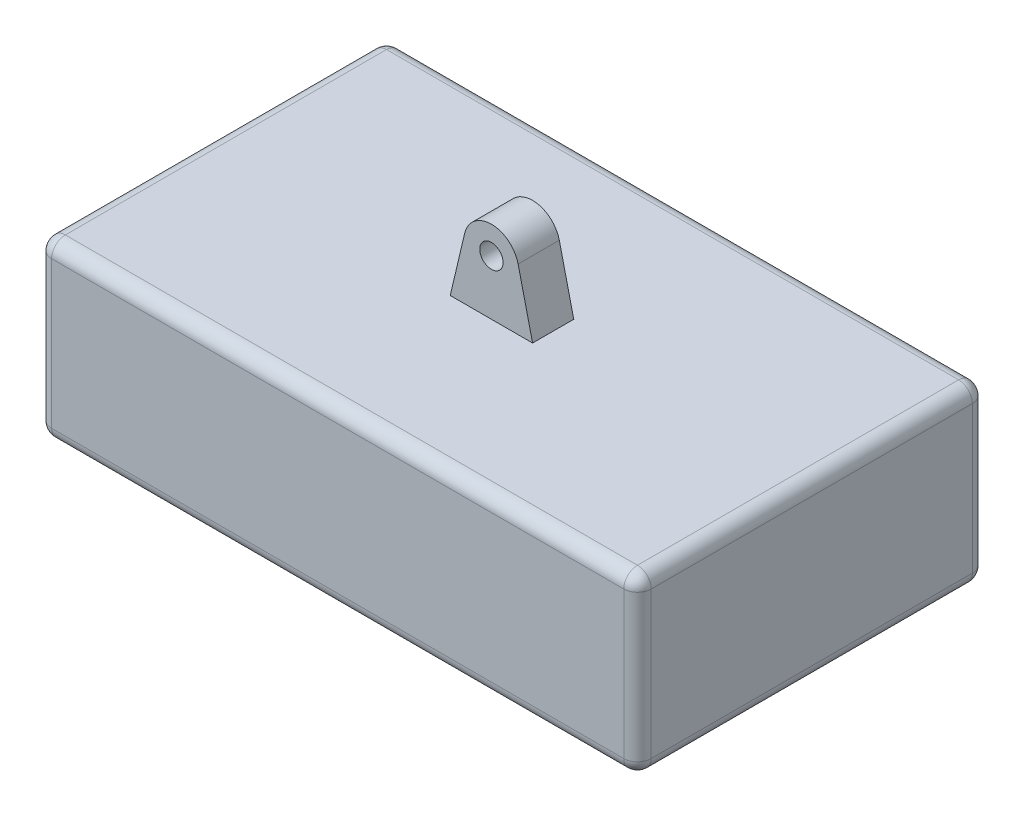
ISO-10303-21;
HEADER;
FILE_DESCRIPTION(('STEP AP214'),'2;1');
FILE_NAME('part.step','',(''),(''),'','','');
FILE_SCHEMA(('AUTOMOTIVE_DESIGN { 1 0 10303 214 1 1 1 1 }'));
ENDSEC;
DATA;
#1=APPLICATION_CONTEXT('core data for automotive mechanical design processes');
#2=APPLICATION_PROTOCOL_DEFINITION('international standard','automotive_design',2000,#1);
#3=PRODUCT_CONTEXT('',#1,'mechanical');
#4=PRODUCT('Part','Part','',(#3));
#5=PRODUCT_RELATED_PRODUCT_CATEGORY('part','',(#4));
#6=PRODUCT_DEFINITION_FORMATION('','',#4);
#7=PRODUCT_DEFINITION_CONTEXT('part definition',#1,'design');
#8=PRODUCT_DEFINITION('design','',#6,#7);
#9=PRODUCT_DEFINITION_SHAPE('','',#8);
#10=(LENGTH_UNIT() NAMED_UNIT(*) SI_UNIT(.MILLI.,.METRE.));
#11=(NAMED_UNIT(*) PLANE_ANGLE_UNIT() SI_UNIT($,.RADIAN.));
#12=(NAMED_UNIT(*) SI_UNIT($,.STERADIAN.) SOLID_ANGLE_UNIT());
#13=UNCERTAINTY_MEASURE_WITH_UNIT(LENGTH_MEASURE(1.E-05),#10,'distance_accuracy_value','');
#14=(GEOMETRIC_REPRESENTATION_CONTEXT(3) GLOBAL_UNCERTAINTY_ASSIGNED_CONTEXT((#13)) GLOBAL_UNIT_ASSIGNED_CONTEXT((#10,
#11,#12)) REPRESENTATION_CONTEXT('',''));
#15=CARTESIAN_POINT('',(0.,0.,0.));
#16=DIRECTION('',(0.,0.,1.));
#17=DIRECTION('',(1.,0.,0.));
#18=AXIS2_PLACEMENT_3D('',#15,#16,#17);
#19=CARTESIAN_POINT('',(-15.,93.5,-7.5));
#20=DIRECTION('',(0.,0.,1.));
#21=DIRECTION('',(1.,0.,0.));
#22=AXIS2_PLACEMENT_3D('',#19,#20,#21);
#23=PLANE('',#22);
#24=CARTESIAN_POINT('',(0.,83.5,-7.5));
#25=DIRECTION('',(0.,0.,-1.));
#26=DIRECTION('',(-1.,0.,0.));
#27=AXIS2_PLACEMENT_3D('',#24,#25,#26);
#28=CIRCLE('',#27,4.25);
#29=CARTESIAN_POINT('',(-4.25,83.5,-7.5));
#30=VERTEX_POINT('',#29);
#31=EDGE_CURVE('E365',#30,#30,#28,.T.);
#32=ORIENTED_EDGE('',*,*,#31,.F.);
#33=EDGE_LOOP('',(#32));
#34=FACE_BOUND('',#33,.T.);
#35=CARTESIAN_POINT('',(0.,83.5,-7.5));
#36=DIRECTION('',(0.,0.,-1.));
#37=DIRECTION('',(-1.,0.,0.));
#38=AXIS2_PLACEMENT_3D('',#35,#36,#37);
#39=CIRCLE('',#38,10.);
#40=CARTESIAN_POINT('',(-9.73212111192935,85.799090833947,-7.5));
#41=VERTEX_POINT('',#40);
#42=CARTESIAN_POINT('',(9.73212111192935,85.799090833947,-7.5));
#43=VERTEX_POINT('',#42);
#44=EDGE_CURVE('E220',#41,#43,#39,.T.);
#45=ORIENTED_EDGE('',*,*,#44,.T.);
#46=DIRECTION('',(-0.229909083394701,0.973212111192934,0.));
#47=VECTOR('',#46,1.);
#48=CARTESIAN_POINT('',(28.4152715320839,6.71274941733419,-7.5));
#49=LINE('',#48,#47);
#50=CARTESIAN_POINT('',(15.,63.5,-7.5));
#51=VERTEX_POINT('',#50);
#52=EDGE_CURVE('E206',#51,#43,#49,.T.);
#53=ORIENTED_EDGE('',*,*,#52,.F.);
#54=DIRECTION('',(-1.,0.,0.));
#55=VECTOR('',#54,1.);
#56=CARTESIAN_POINT('',(-15.,63.5,-7.5));
#57=LINE('',#56,#55);
#58=CARTESIAN_POINT('',(-15.,63.5,-7.5));
#59=VERTEX_POINT('',#58);
#60=EDGE_CURVE('E213',#51,#59,#57,.T.);
#61=ORIENTED_EDGE('',*,*,#60,.T.);
#62=DIRECTION('',(0.229909083394701,0.973212111192934,0.));
#63=VECTOR('',#62,1.);
#64=CARTESIAN_POINT('',(-28.4152715320839,6.71274941733419,-7.5));
#65=LINE('',#64,#63);
#66=EDGE_CURVE('E358',#59,#41,#65,.T.);
#67=ORIENTED_EDGE('',*,*,#66,.T.);
#68=EDGE_LOOP('',(#45,#53,#61,#67));
#69=FACE_BOUND('',#68,.T.);
#70=ADVANCED_FACE('F86',(#34,#69),#23,.F.);
#71=CARTESIAN_POINT('',(-15.,93.5,7.5));
#72=DIRECTION('',(0.,0.,-1.));
#73=DIRECTION('',(-1.,0.,0.));
#74=AXIS2_PLACEMENT_3D('',#71,#72,#73);
#75=PLANE('',#74);
#76=CARTESIAN_POINT('',(0.,83.5,7.5));
#77=DIRECTION('',(0.,0.,-1.));
#78=DIRECTION('',(-1.,0.,0.));
#79=AXIS2_PLACEMENT_3D('',#76,#77,#78);
#80=CIRCLE('',#79,4.25);
#81=CARTESIAN_POINT('',(-4.25,83.5,7.5));
#82=VERTEX_POINT('',#81);
#83=EDGE_CURVE('E214',#82,#82,#80,.F.);
#84=ORIENTED_EDGE('',*,*,#83,.F.);
#85=EDGE_LOOP('',(#84));
#86=FACE_BOUND('',#85,.T.);
#87=DIRECTION('',(0.229909083394701,-0.973212111192935,0.));
#88=VECTOR('',#87,1.);
#89=CARTESIAN_POINT('',(28.4152715320839,6.71274941733419,7.49999999999999));
#90=LINE('',#89,#88);
#91=CARTESIAN_POINT('',(9.73212111192935,85.799090833947,7.49999999999999));
#92=VERTEX_POINT('',#91);
#93=CARTESIAN_POINT('',(15.,63.5,7.5));
#94=VERTEX_POINT('',#93);
#95=EDGE_CURVE('E208',#92,#94,#90,.T.);
#96=ORIENTED_EDGE('',*,*,#95,.F.);
#97=CARTESIAN_POINT('',(0.,83.5,7.5));
#98=DIRECTION('',(0.,0.,-1.));
#99=DIRECTION('',(-1.,0.,0.));
#100=AXIS2_PLACEMENT_3D('',#97,#98,#99);
#101=CIRCLE('',#100,10.);
#102=CARTESIAN_POINT('',(-9.73212111192934,85.799090833947,7.49999999999999));
#103=VERTEX_POINT('',#102);
#104=EDGE_CURVE('E354',#92,#103,#101,.F.);
#105=ORIENTED_EDGE('',*,*,#104,.T.);
#106=DIRECTION('',(-0.229909083394701,-0.973212111192935,0.));
#107=VECTOR('',#106,1.);
#108=CARTESIAN_POINT('',(-28.4152715320839,6.71274941733419,7.49999999999999));
#109=LINE('',#108,#107);
#110=CARTESIAN_POINT('',(-15.,63.5,7.49999999999999));
#111=VERTEX_POINT('',#110);
#112=EDGE_CURVE('E362',#103,#111,#109,.T.);
#113=ORIENTED_EDGE('',*,*,#112,.T.);
#114=DIRECTION('',(1.,0.,0.));
#115=VECTOR('',#114,1.);
#116=CARTESIAN_POINT('',(-15.,63.5,7.5));
#117=LINE('',#116,#115);
#118=EDGE_CURVE('E228',#111,#94,#117,.T.);
#119=ORIENTED_EDGE('',*,*,#118,.T.);
#120=EDGE_LOOP('',(#96,#105,#113,#119));
#121=FACE_BOUND('',#120,.T.);
#122=ADVANCED_FACE('F372',(#86,#121),#75,.F.);
#123=CARTESIAN_POINT('',(0.,63.5,0.));
#124=DIRECTION('',(0.,-1.,0.));
#125=DIRECTION('',(0.,0.,-1.));
#126=AXIS2_PLACEMENT_3D('',#123,#124,#125);
#127=PLANE('',#126);
#128=DIRECTION('',(0.,0.,1.));
#129=VECTOR('',#128,1.);
#130=CARTESIAN_POINT('',(-104.22,63.5,0.));
#131=LINE('',#130,#129);
#132=CARTESIAN_POINT('',(-104.22,63.5,-58.5));
#133=VERTEX_POINT('',#132);
#134=CARTESIAN_POINT('',(-104.22,63.5,58.5));
#135=VERTEX_POINT('',#134);
#136=EDGE_CURVE('E278',#133,#135,#131,.T.);
#137=ORIENTED_EDGE('',*,*,#136,.T.);
#138=DIRECTION('',(1.,0.,0.));
#139=VECTOR('',#138,1.);
#140=CARTESIAN_POINT('',(0.,63.5,58.5));
#141=LINE('',#140,#139);
#142=CARTESIAN_POINT('',(104.22,63.5,58.5));
#143=VERTEX_POINT('',#142);
#144=EDGE_CURVE('E12',#135,#143,#141,.T.);
#145=ORIENTED_EDGE('',*,*,#144,.T.);
#146=DIRECTION('',(0.,0.,-1.));
#147=VECTOR('',#146,1.);
#148=CARTESIAN_POINT('',(104.22,63.5,0.));
#149=LINE('',#148,#147);
#150=CARTESIAN_POINT('',(104.22,63.5,-58.5));
#151=VERTEX_POINT('',#150);
#152=EDGE_CURVE('E95',#143,#151,#149,.T.);
#153=ORIENTED_EDGE('',*,*,#152,.T.);
#154=DIRECTION('',(-1.,0.,0.));
#155=VECTOR('',#154,1.);
#156=CARTESIAN_POINT('',(0.,63.5,-58.5));
#157=LINE('',#156,#155);
#158=EDGE_CURVE('E280',#151,#133,#157,.T.);
#159=ORIENTED_EDGE('',*,*,#158,.T.);
#160=EDGE_LOOP('',(#137,#145,#153,#159));
#161=FACE_BOUND('',#160,.T.);
#162=DIRECTION('',(0.,0.,-1.));
#163=VECTOR('',#162,1.);
#164=CARTESIAN_POINT('',(15.,63.5,-7.5));
#165=LINE('',#164,#163);
#166=EDGE_CURVE('E202',#94,#51,#165,.T.);
#167=ORIENTED_EDGE('',*,*,#166,.F.);
#168=ORIENTED_EDGE('',*,*,#118,.F.);
#169=DIRECTION('',(0.,0.,1.));
#170=VECTOR('',#169,1.);
#171=CARTESIAN_POINT('',(-15.,63.5,-7.5));
#172=LINE('',#171,#170);
#173=EDGE_CURVE('E226',#59,#111,#172,.T.);
#174=ORIENTED_EDGE('',*,*,#173,.F.);
#175=ORIENTED_EDGE('',*,*,#60,.F.);
#176=EDGE_LOOP('',(#167,#168,#174,#175));
#177=FACE_BOUND('',#176,.T.);
#178=ADVANCED_FACE('F225',(#161,#177),#127,.F.);
#179=CARTESIAN_POINT('',(-109.22,63.5,-63.5));
#180=DIRECTION('',(1.,0.,0.));
#181=DIRECTION('',(0.,0.,-1.));
#182=AXIS2_PLACEMENT_3D('',#179,#180,#181);
#183=PLANE('',#182);
#184=DIRECTION('',(0.,-1.,0.));
#185=VECTOR('',#184,1.);
#186=CARTESIAN_POINT('',(-109.22,63.5,-58.5));
#187=LINE('',#186,#185);
#188=CARTESIAN_POINT('',(-109.22,58.5,-58.5));
#189=VERTEX_POINT('',#188);
#190=CARTESIAN_POINT('',(-109.22,5.,-58.5));
#191=VERTEX_POINT('',#190);
#192=EDGE_CURVE('E271',#189,#191,#187,.T.);
#193=ORIENTED_EDGE('',*,*,#192,.T.);
#194=DIRECTION('',(0.,0.,1.));
#195=VECTOR('',#194,1.);
#196=CARTESIAN_POINT('',(-109.22,5.,63.5));
#197=LINE('',#196,#195);
#198=CARTESIAN_POINT('',(-109.22,5.,58.5));
#199=VERTEX_POINT('',#198);
#200=EDGE_CURVE('E275',#191,#199,#197,.T.);
#201=ORIENTED_EDGE('',*,*,#200,.T.);
#202=DIRECTION('',(0.,-1.,0.));
#203=VECTOR('',#202,1.);
#204=CARTESIAN_POINT('',(-109.22,63.5,58.5));
#205=LINE('',#204,#203);
#206=CARTESIAN_POINT('',(-109.22,58.5,58.5));
#207=VERTEX_POINT('',#206);
#208=EDGE_CURVE('E273',#199,#207,#205,.F.);
#209=ORIENTED_EDGE('',*,*,#208,.T.);
#210=DIRECTION('',(0.,0.,1.));
#211=VECTOR('',#210,1.);
#212=CARTESIAN_POINT('',(-109.22,58.5,-63.5));
#213=LINE('',#212,#211);
#214=EDGE_CURVE('E269',#207,#189,#213,.F.);
#215=ORIENTED_EDGE('',*,*,#214,.T.);
#216=EDGE_LOOP('',(#193,#201,#209,#215));
#217=FACE_BOUND('',#216,.T.);
#218=ADVANCED_FACE('F400',(#217),#183,.F.);
#219=CARTESIAN_POINT('',(109.22,63.5,63.5));
#220=DIRECTION('',(0.,0.,-1.));
#221=DIRECTION('',(-1.,0.,0.));
#222=AXIS2_PLACEMENT_3D('',#219,#220,#221);
#223=PLANE('',#222);
#224=DIRECTION('',(0.,-1.,0.));
#225=VECTOR('',#224,1.);
#226=CARTESIAN_POINT('',(-104.22,63.5,63.5));
#227=LINE('',#226,#225);
#228=CARTESIAN_POINT('',(-104.22,58.5,63.5));
#229=VERTEX_POINT('',#228);
#230=CARTESIAN_POINT('',(-104.22,5.,63.5));
#231=VERTEX_POINT('',#230);
#232=EDGE_CURVE('E235',#229,#231,#227,.T.);
#233=ORIENTED_EDGE('',*,*,#232,.T.);
#234=DIRECTION('',(1.,0.,0.));
#235=VECTOR('',#234,1.);
#236=CARTESIAN_POINT('',(109.22,5.,63.5));
#237=LINE('',#236,#235);
#238=CARTESIAN_POINT('',(104.22,5.,63.5));
#239=VERTEX_POINT('',#238);
#240=EDGE_CURVE('E239',#231,#239,#237,.T.);
#241=ORIENTED_EDGE('',*,*,#240,.T.);
#242=DIRECTION('',(0.,-1.,0.));
#243=VECTOR('',#242,1.);
#244=CARTESIAN_POINT('',(104.22,63.5,63.5));
#245=LINE('',#244,#243);
#246=CARTESIAN_POINT('',(104.22,58.5,63.5));
#247=VERTEX_POINT('',#246);
#248=EDGE_CURVE('E237',#239,#247,#245,.F.);
#249=ORIENTED_EDGE('',*,*,#248,.T.);
#250=DIRECTION('',(1.,0.,0.));
#251=VECTOR('',#250,1.);
#252=CARTESIAN_POINT('',(109.22,58.5,63.5));
#253=LINE('',#252,#251);
#254=EDGE_CURVE('E233',#247,#229,#253,.F.);
#255=ORIENTED_EDGE('',*,*,#254,.T.);
#256=EDGE_LOOP('',(#233,#241,#249,#255));
#257=FACE_BOUND('',#256,.T.);
#258=ADVANCED_FACE('F411',(#257),#223,.F.);
#259=CARTESIAN_POINT('',(109.22,63.5,-63.5));
#260=DIRECTION('',(-1.,0.,0.));
#261=DIRECTION('',(0.,0.,1.));
#262=AXIS2_PLACEMENT_3D('',#259,#260,#261);
#263=PLANE('',#262);
#264=DIRECTION('',(0.,-1.,0.));
#265=VECTOR('',#264,1.);
#266=CARTESIAN_POINT('',(109.22,63.5,58.5));
#267=LINE('',#266,#265);
#268=CARTESIAN_POINT('',(109.22,58.5,58.5));
#269=VERTEX_POINT('',#268);
#270=CARTESIAN_POINT('',(109.22,5.,58.5));
#271=VERTEX_POINT('',#270);
#272=EDGE_CURVE('E253',#269,#271,#267,.T.);
#273=ORIENTED_EDGE('',*,*,#272,.T.);
#274=DIRECTION('',(0.,0.,-1.));
#275=VECTOR('',#274,1.);
#276=CARTESIAN_POINT('',(109.22,5.,-63.5));
#277=LINE('',#276,#275);
#278=CARTESIAN_POINT('',(109.22,5.,-58.5));
#279=VERTEX_POINT('',#278);
#280=EDGE_CURVE('E257',#271,#279,#277,.T.);
#281=ORIENTED_EDGE('',*,*,#280,.T.);
#282=DIRECTION('',(0.,-1.,0.));
#283=VECTOR('',#282,1.);
#284=CARTESIAN_POINT('',(109.22,63.5,-58.5));
#285=LINE('',#284,#283);
#286=CARTESIAN_POINT('',(109.22,58.5,-58.5));
#287=VERTEX_POINT('',#286);
#288=EDGE_CURVE('E255',#279,#287,#285,.F.);
#289=ORIENTED_EDGE('',*,*,#288,.T.);
#290=DIRECTION('',(0.,0.,-1.));
#291=VECTOR('',#290,1.);
#292=CARTESIAN_POINT('',(109.22,58.5,-63.5));
#293=LINE('',#292,#291);
#294=EDGE_CURVE('E251',#287,#269,#293,.F.);
#295=ORIENTED_EDGE('',*,*,#294,.T.);
#296=EDGE_LOOP('',(#273,#281,#289,#295));
#297=FACE_BOUND('',#296,.T.);
#298=ADVANCED_FACE('F407',(#297),#263,.F.);
#299=CARTESIAN_POINT('',(109.22,63.5,-63.5));
#300=DIRECTION('',(0.,0.,1.));
#301=DIRECTION('',(1.,0.,0.));
#302=AXIS2_PLACEMENT_3D('',#299,#300,#301);
#303=PLANE('',#302);
#304=DIRECTION('',(0.,-1.,0.));
#305=VECTOR('',#304,1.);
#306=CARTESIAN_POINT('',(104.22,63.5,-63.5));
#307=LINE('',#306,#305);
#308=CARTESIAN_POINT('',(104.22,58.5,-63.5));
#309=VERTEX_POINT('',#308);
#310=CARTESIAN_POINT('',(104.22,5.,-63.5));
#311=VERTEX_POINT('',#310);
#312=EDGE_CURVE('E264',#309,#311,#307,.T.);
#313=ORIENTED_EDGE('',*,*,#312,.T.);
#314=DIRECTION('',(-1.,0.,0.));
#315=VECTOR('',#314,1.);
#316=CARTESIAN_POINT('',(-109.22,5.,-63.5));
#317=LINE('',#316,#315);
#318=CARTESIAN_POINT('',(-104.22,5.,-63.5));
#319=VERTEX_POINT('',#318);
#320=EDGE_CURVE('E266',#311,#319,#317,.T.);
#321=ORIENTED_EDGE('',*,*,#320,.T.);
#322=DIRECTION('',(0.,-1.,0.));
#323=VECTOR('',#322,1.);
#324=CARTESIAN_POINT('',(-104.22,63.5,-63.5));
#325=LINE('',#324,#323);
#326=CARTESIAN_POINT('',(-104.22,58.5,-63.5));
#327=VERTEX_POINT('',#326);
#328=EDGE_CURVE('E262',#319,#327,#325,.F.);
#329=ORIENTED_EDGE('',*,*,#328,.T.);
#330=DIRECTION('',(-1.,0.,0.));
#331=VECTOR('',#330,1.);
#332=CARTESIAN_POINT('',(109.22,58.5,-63.5));
#333=LINE('',#332,#331);
#334=EDGE_CURVE('E260',#327,#309,#333,.F.);
#335=ORIENTED_EDGE('',*,*,#334,.T.);
#336=EDGE_LOOP('',(#313,#321,#329,#335));
#337=FACE_BOUND('',#336,.T.);
#338=ADVANCED_FACE('F403',(#337),#303,.F.);
#339=CARTESIAN_POINT('',(0.,0.,0.));
#340=DIRECTION('',(0.,-1.,0.));
#341=DIRECTION('',(0.,0.,-1.));
#342=AXIS2_PLACEMENT_3D('',#339,#340,#341);
#343=PLANE('',#342);
#344=DIRECTION('',(0.,0.,-1.));
#345=VECTOR('',#344,1.);
#346=CARTESIAN_POINT('',(104.22,0.,63.5));
#347=LINE('',#346,#345);
#348=CARTESIAN_POINT('',(104.22,0.,-58.5));
#349=VERTEX_POINT('',#348);
#350=CARTESIAN_POINT('',(104.22,0.,58.5));
#351=VERTEX_POINT('',#350);
#352=EDGE_CURVE('E246',#349,#351,#347,.F.);
#353=ORIENTED_EDGE('',*,*,#352,.T.);
#354=DIRECTION('',(1.,0.,0.));
#355=VECTOR('',#354,1.);
#356=CARTESIAN_POINT('',(-109.22,0.,58.5));
#357=LINE('',#356,#355);
#358=CARTESIAN_POINT('',(-104.22,0.,58.5));
#359=VERTEX_POINT('',#358);
#360=EDGE_CURVE('E248',#351,#359,#357,.F.);
#361=ORIENTED_EDGE('',*,*,#360,.T.);
#362=DIRECTION('',(0.,0.,1.));
#363=VECTOR('',#362,1.);
#364=CARTESIAN_POINT('',(-104.22,0.,-63.5));
#365=LINE('',#364,#363);
#366=CARTESIAN_POINT('',(-104.22,0.,-58.5));
#367=VERTEX_POINT('',#366);
#368=EDGE_CURVE('E242',#359,#367,#365,.F.);
#369=ORIENTED_EDGE('',*,*,#368,.T.);
#370=DIRECTION('',(-1.,0.,0.));
#371=VECTOR('',#370,1.);
#372=CARTESIAN_POINT('',(109.22,0.,-58.5));
#373=LINE('',#372,#371);
#374=EDGE_CURVE('E244',#367,#349,#373,.F.);
#375=ORIENTED_EDGE('',*,*,#374,.T.);
#376=EDGE_LOOP('',(#353,#361,#369,#375));
#377=FACE_BOUND('',#376,.T.);
#378=ADVANCED_FACE('F388',(#377),#343,.T.);
#379=CARTESIAN_POINT('',(0.,83.5,63.501));
#380=DIRECTION('',(0.,0.,-1.));
#381=DIRECTION('',(-1.,0.,0.));
#382=AXIS2_PLACEMENT_3D('',#379,#380,#381);
#383=CYLINDRICAL_SURFACE('',#382,4.25);
#384=ORIENTED_EDGE('',*,*,#31,.T.);
#385=EDGE_LOOP('',(#384));
#386=FACE_BOUND('',#385,.T.);
#387=ORIENTED_EDGE('',*,*,#83,.T.);
#388=EDGE_LOOP('',(#387));
#389=FACE_BOUND('',#388,.T.);
#390=ADVANCED_FACE('F370',(#386,#389),#383,.F.);
#391=CARTESIAN_POINT('',(0.,83.5,63.501));
#392=DIRECTION('',(0.,0.,-1.));
#393=DIRECTION('',(-1.,0.,0.));
#394=AXIS2_PLACEMENT_3D('',#391,#392,#393);
#395=CYLINDRICAL_SURFACE('',#394,10.);
#396=ORIENTED_EDGE('',*,*,#104,.F.);
#397=DIRECTION('',(0.,0.,-1.));
#398=VECTOR('',#397,1.);
#399=CARTESIAN_POINT('',(9.73212111192935,85.799090833947,63.501));
#400=LINE('',#399,#398);
#401=EDGE_CURVE('E222',#92,#43,#400,.T.);
#402=ORIENTED_EDGE('',*,*,#401,.T.);
#403=ORIENTED_EDGE('',*,*,#44,.F.);
#404=DIRECTION('',(0.,0.,-1.));
#405=VECTOR('',#404,1.);
#406=CARTESIAN_POINT('',(-9.73212111192935,85.799090833947,63.501));
#407=LINE('',#406,#405);
#408=EDGE_CURVE('E360',#103,#41,#407,.T.);
#409=ORIENTED_EDGE('',*,*,#408,.F.);
#410=EDGE_LOOP('',(#396,#402,#403,#409));
#411=FACE_BOUND('',#410,.T.);
#412=ADVANCED_FACE('F380',(#411),#395,.T.);
#413=CARTESIAN_POINT('',(-28.4152715320839,6.71274941733419,63.501));
#414=DIRECTION('',(-0.973212111192934,0.229909083394701,0.));
#415=DIRECTION('',(-0.229909083394701,-0.973212111192934,0.));
#416=AXIS2_PLACEMENT_3D('',#413,#414,#415);
#417=PLANE('',#416);
#418=ORIENTED_EDGE('',*,*,#408,.T.);
#419=ORIENTED_EDGE('',*,*,#66,.F.);
#420=ORIENTED_EDGE('',*,*,#173,.T.);
#421=ORIENTED_EDGE('',*,*,#112,.F.);
#422=EDGE_LOOP('',(#418,#419,#420,#421));
#423=FACE_BOUND('',#422,.T.);
#424=ADVANCED_FACE('F378',(#423),#417,.T.);
#425=CARTESIAN_POINT('',(28.4152715320839,6.71274941733419,63.501));
#426=DIRECTION('',(-0.973212111192934,-0.229909083394701,0.));
#427=DIRECTION('',(0.229909083394701,-0.973212111192934,0.));
#428=AXIS2_PLACEMENT_3D('',#425,#426,#427);
#429=PLANE('',#428);
#430=ORIENTED_EDGE('',*,*,#95,.T.);
#431=ORIENTED_EDGE('',*,*,#166,.T.);
#432=ORIENTED_EDGE('',*,*,#52,.T.);
#433=ORIENTED_EDGE('',*,*,#401,.F.);
#434=EDGE_LOOP('',(#430,#431,#432,#433));
#435=FACE_BOUND('',#434,.T.);
#436=ADVANCED_FACE('F204',(#435),#429,.F.);
#437=CARTESIAN_POINT('',(0.,58.5,-58.5));
#438=DIRECTION('',(-1.,0.,0.));
#439=DIRECTION('',(0.,0.,1.));
#440=AXIS2_PLACEMENT_3D('',#437,#438,#439);
#441=CYLINDRICAL_SURFACE('',#440,5.);
#442=CARTESIAN_POINT('',(-104.22,58.5,-58.5));
#443=DIRECTION('',(-1.,0.,0.));
#444=DIRECTION('',(0.,0.,1.));
#445=AXIS2_PLACEMENT_3D('',#442,#443,#444);
#446=CIRCLE('',#445,5.);
#447=EDGE_CURVE('E90',#133,#327,#446,.T.);
#448=ORIENTED_EDGE('',*,*,#447,.F.);
#449=ORIENTED_EDGE('',*,*,#158,.F.);
#450=CARTESIAN_POINT('',(104.22,58.5,-58.5));
#451=DIRECTION('',(1.,0.,0.));
#452=DIRECTION('',(0.,1.,0.));
#453=AXIS2_PLACEMENT_3D('',#450,#451,#452);
#454=CIRCLE('',#453,5.);
#455=EDGE_CURVE('E340',#309,#151,#454,.T.);
#456=ORIENTED_EDGE('',*,*,#455,.F.);
#457=ORIENTED_EDGE('',*,*,#334,.F.);
#458=EDGE_LOOP('',(#448,#449,#456,#457));
#459=FACE_BOUND('',#458,.T.);
#460=ADVANCED_FACE('F88',(#459),#441,.T.);
#461=CARTESIAN_POINT('',(-104.22,58.5,-58.5));
#462=DIRECTION('',(0.,0.,1.));
#463=DIRECTION('',(1.,0.,0.));
#464=AXIS2_PLACEMENT_3D('',#461,#462,#463);
#465=SPHERICAL_SURFACE('',#464,5.);
#466=CARTESIAN_POINT('',(-104.22,58.5,-58.5));
#467=DIRECTION('',(0.,0.,-1.));
#468=DIRECTION('',(-1.,0.,0.));
#469=AXIS2_PLACEMENT_3D('',#466,#467,#468);
#470=CIRCLE('',#469,5.);
#471=EDGE_CURVE('E335',#133,#189,#470,.F.);
#472=ORIENTED_EDGE('',*,*,#471,.F.);
#473=ORIENTED_EDGE('',*,*,#447,.T.);
#474=CARTESIAN_POINT('',(-104.22,58.5,-58.5));
#475=DIRECTION('',(0.,1.,0.));
#476=DIRECTION('',(0.,0.,1.));
#477=AXIS2_PLACEMENT_3D('',#474,#475,#476);
#478=CIRCLE('',#477,5.);
#479=EDGE_CURVE('E338',#189,#327,#478,.F.);
#480=ORIENTED_EDGE('',*,*,#479,.F.);
#481=EDGE_LOOP('',(#472,#473,#480));
#482=FACE_BOUND('',#481,.T.);
#483=ADVANCED_FACE('F488',(#482),#465,.T.);
#484=CARTESIAN_POINT('',(104.22,58.5,-58.5));
#485=DIRECTION('',(0.,0.,1.));
#486=DIRECTION('',(1.,0.,0.));
#487=AXIS2_PLACEMENT_3D('',#484,#485,#486);
#488=SPHERICAL_SURFACE('',#487,5.);
#489=CARTESIAN_POINT('',(104.22,58.5,-58.5));
#490=DIRECTION('',(0.,1.,0.));
#491=DIRECTION('',(0.,0.,1.));
#492=AXIS2_PLACEMENT_3D('',#489,#490,#491);
#493=CIRCLE('',#492,5.);
#494=EDGE_CURVE('E329',#309,#287,#493,.F.);
#495=ORIENTED_EDGE('',*,*,#494,.F.);
#496=ORIENTED_EDGE('',*,*,#455,.T.);
#497=CARTESIAN_POINT('',(104.22,58.5,-58.5));
#498=DIRECTION('',(0.,0.,-1.));
#499=DIRECTION('',(-1.,0.,0.));
#500=AXIS2_PLACEMENT_3D('',#497,#498,#499);
#501=CIRCLE('',#500,5.);
#502=EDGE_CURVE('E332',#287,#151,#501,.F.);
#503=ORIENTED_EDGE('',*,*,#502,.F.);
#504=EDGE_LOOP('',(#495,#496,#503));
#505=FACE_BOUND('',#504,.T.);
#506=ADVANCED_FACE('F485',(#505),#488,.T.);
#507=CARTESIAN_POINT('',(-104.22,63.5,-58.5));
#508=DIRECTION('',(0.,-1.,0.));
#509=DIRECTION('',(0.,0.,-1.));
#510=AXIS2_PLACEMENT_3D('',#507,#508,#509);
#511=CYLINDRICAL_SURFACE('',#510,5.);
#512=ORIENTED_EDGE('',*,*,#479,.T.);
#513=ORIENTED_EDGE('',*,*,#328,.F.);
#514=CARTESIAN_POINT('',(-104.22,5.,-58.5));
#515=DIRECTION('',(0.,-1.,0.));
#516=DIRECTION('',(0.,0.,-1.));
#517=AXIS2_PLACEMENT_3D('',#514,#515,#516);
#518=CIRCLE('',#517,5.);
#519=EDGE_CURVE('E324',#191,#319,#518,.T.);
#520=ORIENTED_EDGE('',*,*,#519,.F.);
#521=ORIENTED_EDGE('',*,*,#192,.F.);
#522=EDGE_LOOP('',(#512,#513,#520,#521));
#523=FACE_BOUND('',#522,.T.);
#524=ADVANCED_FACE('F481',(#523),#511,.T.);
#525=CARTESIAN_POINT('',(-104.22,58.5,0.));
#526=DIRECTION('',(0.,0.,1.));
#527=DIRECTION('',(1.,0.,0.));
#528=AXIS2_PLACEMENT_3D('',#525,#526,#527);
#529=CYLINDRICAL_SURFACE('',#528,5.);
#530=ORIENTED_EDGE('',*,*,#471,.T.);
#531=ORIENTED_EDGE('',*,*,#214,.F.);
#532=CARTESIAN_POINT('',(-104.22,58.5,58.5));
#533=DIRECTION('',(0.,0.,1.));
#534=DIRECTION('',(1.,0.,0.));
#535=AXIS2_PLACEMENT_3D('',#532,#533,#534);
#536=CIRCLE('',#535,5.);
#537=EDGE_CURVE('E321',#135,#207,#536,.T.);
#538=ORIENTED_EDGE('',*,*,#537,.F.);
#539=ORIENTED_EDGE('',*,*,#136,.F.);
#540=EDGE_LOOP('',(#530,#531,#538,#539));
#541=FACE_BOUND('',#540,.T.);
#542=ADVANCED_FACE('F477',(#541),#529,.T.);
#543=CARTESIAN_POINT('',(0.,58.5,58.5));
#544=DIRECTION('',(1.,0.,0.));
#545=DIRECTION('',(0.,0.,-1.));
#546=AXIS2_PLACEMENT_3D('',#543,#544,#545);
#547=CYLINDRICAL_SURFACE('',#546,5.);
#548=CARTESIAN_POINT('',(104.22,58.5,58.5));
#549=DIRECTION('',(1.,0.,0.));
#550=DIRECTION('',(0.,0.,-1.));
#551=AXIS2_PLACEMENT_3D('',#548,#549,#550);
#552=CIRCLE('',#551,5.);
#553=EDGE_CURVE('E316',#143,#247,#552,.T.);
#554=ORIENTED_EDGE('',*,*,#553,.F.);
#555=ORIENTED_EDGE('',*,*,#144,.F.);
#556=CARTESIAN_POINT('',(-104.22,58.5,58.5));
#557=DIRECTION('',(-1.,0.,0.));
#558=DIRECTION('',(0.,-1.,0.));
#559=AXIS2_PLACEMENT_3D('',#556,#557,#558);
#560=CIRCLE('',#559,5.);
#561=EDGE_CURVE('E318',#229,#135,#560,.T.);
#562=ORIENTED_EDGE('',*,*,#561,.F.);
#563=ORIENTED_EDGE('',*,*,#254,.F.);
#564=EDGE_LOOP('',(#554,#555,#562,#563));
#565=FACE_BOUND('',#564,.T.);
#566=ADVANCED_FACE('F473',(#565),#547,.T.);
#567=CARTESIAN_POINT('',(104.22,58.5,0.));
#568=DIRECTION('',(0.,0.,-1.));
#569=DIRECTION('',(-1.,0.,0.));
#570=AXIS2_PLACEMENT_3D('',#567,#568,#569);
#571=CYLINDRICAL_SURFACE('',#570,5.);
#572=ORIENTED_EDGE('',*,*,#502,.T.);
#573=ORIENTED_EDGE('',*,*,#152,.F.);
#574=CARTESIAN_POINT('',(104.22,58.5,58.5));
#575=DIRECTION('',(0.,0.,1.));
#576=DIRECTION('',(0.,-1.,0.));
#577=AXIS2_PLACEMENT_3D('',#574,#575,#576);
#578=CIRCLE('',#577,5.);
#579=EDGE_CURVE('E103',#269,#143,#578,.T.);
#580=ORIENTED_EDGE('',*,*,#579,.F.);
#581=ORIENTED_EDGE('',*,*,#294,.F.);
#582=EDGE_LOOP('',(#572,#573,#580,#581));
#583=FACE_BOUND('',#582,.T.);
#584=ADVANCED_FACE('F469',(#583),#571,.T.);
#585=CARTESIAN_POINT('',(104.22,63.5,-58.5));
#586=DIRECTION('',(0.,-1.,0.));
#587=DIRECTION('',(0.,0.,-1.));
#588=AXIS2_PLACEMENT_3D('',#585,#586,#587);
#589=CYLINDRICAL_SURFACE('',#588,5.);
#590=ORIENTED_EDGE('',*,*,#494,.T.);
#591=ORIENTED_EDGE('',*,*,#288,.F.);
#592=CARTESIAN_POINT('',(104.22,5.,-58.5));
#593=DIRECTION('',(0.,-1.,0.));
#594=DIRECTION('',(0.,0.,-1.));
#595=AXIS2_PLACEMENT_3D('',#592,#593,#594);
#596=CIRCLE('',#595,5.);
#597=EDGE_CURVE('E312',#311,#279,#596,.T.);
#598=ORIENTED_EDGE('',*,*,#597,.F.);
#599=ORIENTED_EDGE('',*,*,#312,.F.);
#600=EDGE_LOOP('',(#590,#591,#598,#599));
#601=FACE_BOUND('',#600,.T.);
#602=ADVANCED_FACE('F465',(#601),#589,.T.);
#603=CARTESIAN_POINT('',(109.22,5.,-58.5));
#604=DIRECTION('',(1.,0.,0.));
#605=DIRECTION('',(0.,0.,-1.));
#606=AXIS2_PLACEMENT_3D('',#603,#604,#605);
#607=CYLINDRICAL_SURFACE('',#606,5.);
#608=CARTESIAN_POINT('',(-104.22,5.,-58.5));
#609=DIRECTION('',(-1.,0.,0.));
#610=DIRECTION('',(0.,0.,1.));
#611=AXIS2_PLACEMENT_3D('',#608,#609,#610);
#612=CIRCLE('',#611,5.);
#613=EDGE_CURVE('E326',#319,#367,#612,.T.);
#614=ORIENTED_EDGE('',*,*,#613,.F.);
#615=ORIENTED_EDGE('',*,*,#320,.F.);
#616=CARTESIAN_POINT('',(104.22,5.,-58.5));
#617=DIRECTION('',(1.,0.,0.));
#618=DIRECTION('',(0.,0.,-1.));
#619=AXIS2_PLACEMENT_3D('',#616,#617,#618);
#620=CIRCLE('',#619,5.);
#621=EDGE_CURVE('E309',#349,#311,#620,.T.);
#622=ORIENTED_EDGE('',*,*,#621,.F.);
#623=ORIENTED_EDGE('',*,*,#374,.F.);
#624=EDGE_LOOP('',(#614,#615,#622,#623));
#625=FACE_BOUND('',#624,.T.);
#626=ADVANCED_FACE('F461',(#625),#607,.T.);
#627=CARTESIAN_POINT('',(-104.22,5.,-58.5));
#628=DIRECTION('',(0.,0.,1.));
#629=DIRECTION('',(1.,0.,0.));
#630=AXIS2_PLACEMENT_3D('',#627,#628,#629);
#631=SPHERICAL_SURFACE('',#630,5.);
#632=ORIENTED_EDGE('',*,*,#519,.T.);
#633=ORIENTED_EDGE('',*,*,#613,.T.);
#634=CARTESIAN_POINT('',(-104.22,5.,-58.5));
#635=DIRECTION('',(0.,0.,-1.));
#636=DIRECTION('',(-1.,0.,0.));
#637=AXIS2_PLACEMENT_3D('',#634,#635,#636);
#638=CIRCLE('',#637,5.);
#639=EDGE_CURVE('E306',#191,#367,#638,.F.);
#640=ORIENTED_EDGE('',*,*,#639,.F.);
#641=EDGE_LOOP('',(#632,#633,#640));
#642=FACE_BOUND('',#641,.T.);
#643=ADVANCED_FACE('F457',(#642),#631,.T.);
#644=CARTESIAN_POINT('',(-104.22,58.5,58.5));
#645=DIRECTION('',(0.,0.,1.));
#646=DIRECTION('',(1.,0.,0.));
#647=AXIS2_PLACEMENT_3D('',#644,#645,#646);
#648=SPHERICAL_SURFACE('',#647,5.);
#649=ORIENTED_EDGE('',*,*,#561,.T.);
#650=ORIENTED_EDGE('',*,*,#537,.T.);
#651=CARTESIAN_POINT('',(-104.22,58.5,58.5));
#652=DIRECTION('',(0.,1.,0.));
#653=DIRECTION('',(0.,0.,1.));
#654=AXIS2_PLACEMENT_3D('',#651,#652,#653);
#655=CIRCLE('',#654,5.);
#656=EDGE_CURVE('E303',#229,#207,#655,.F.);
#657=ORIENTED_EDGE('',*,*,#656,.F.);
#658=EDGE_LOOP('',(#649,#650,#657));
#659=FACE_BOUND('',#658,.T.);
#660=ADVANCED_FACE('F454',(#659),#648,.T.);
#661=CARTESIAN_POINT('',(104.22,58.5,58.5));
#662=DIRECTION('',(0.,0.,1.));
#663=DIRECTION('',(1.,0.,0.));
#664=AXIS2_PLACEMENT_3D('',#661,#662,#663);
#665=SPHERICAL_SURFACE('',#664,5.);
#666=ORIENTED_EDGE('',*,*,#579,.T.);
#667=ORIENTED_EDGE('',*,*,#553,.T.);
#668=CARTESIAN_POINT('',(104.22,58.5,58.5));
#669=DIRECTION('',(0.,1.,0.));
#670=DIRECTION('',(0.,0.,1.));
#671=AXIS2_PLACEMENT_3D('',#668,#669,#670);
#672=CIRCLE('',#671,5.);
#673=EDGE_CURVE('E300',#269,#247,#672,.F.);
#674=ORIENTED_EDGE('',*,*,#673,.F.);
#675=EDGE_LOOP('',(#666,#667,#674));
#676=FACE_BOUND('',#675,.T.);
#677=ADVANCED_FACE('F450',(#676),#665,.T.);
#678=CARTESIAN_POINT('',(104.22,5.,-58.5));
#679=DIRECTION('',(0.,0.,1.));
#680=DIRECTION('',(1.,0.,0.));
#681=AXIS2_PLACEMENT_3D('',#678,#679,#680);
#682=SPHERICAL_SURFACE('',#681,5.);
#683=ORIENTED_EDGE('',*,*,#621,.T.);
#684=ORIENTED_EDGE('',*,*,#597,.T.);
#685=CARTESIAN_POINT('',(104.22,5.,-58.5));
#686=DIRECTION('',(0.,0.,-1.));
#687=DIRECTION('',(-1.,0.,0.));
#688=AXIS2_PLACEMENT_3D('',#685,#686,#687);
#689=CIRCLE('',#688,5.);
#690=EDGE_CURVE('E298',#349,#279,#689,.F.);
#691=ORIENTED_EDGE('',*,*,#690,.F.);
#692=EDGE_LOOP('',(#683,#684,#691));
#693=FACE_BOUND('',#692,.T.);
#694=ADVANCED_FACE('F446',(#693),#682,.T.);
#695=CARTESIAN_POINT('',(-104.22,5.,-63.5));
#696=DIRECTION('',(0.,0.,-1.));
#697=DIRECTION('',(-1.,0.,0.));
#698=AXIS2_PLACEMENT_3D('',#695,#696,#697);
#699=CYLINDRICAL_SURFACE('',#698,5.);
#700=ORIENTED_EDGE('',*,*,#639,.T.);
#701=ORIENTED_EDGE('',*,*,#368,.F.);
#702=CARTESIAN_POINT('',(-104.22,5.,58.5));
#703=DIRECTION('',(0.,0.,1.));
#704=DIRECTION('',(1.,0.,0.));
#705=AXIS2_PLACEMENT_3D('',#702,#703,#704);
#706=CIRCLE('',#705,5.);
#707=EDGE_CURVE('E295',#199,#359,#706,.T.);
#708=ORIENTED_EDGE('',*,*,#707,.F.);
#709=ORIENTED_EDGE('',*,*,#200,.F.);
#710=EDGE_LOOP('',(#700,#701,#708,#709));
#711=FACE_BOUND('',#710,.T.);
#712=ADVANCED_FACE('F442',(#711),#699,.T.);
#713=CARTESIAN_POINT('',(-104.22,63.5,58.5));
#714=DIRECTION('',(0.,-1.,0.));
#715=DIRECTION('',(0.,0.,-1.));
#716=AXIS2_PLACEMENT_3D('',#713,#714,#715);
#717=CYLINDRICAL_SURFACE('',#716,5.);
#718=ORIENTED_EDGE('',*,*,#656,.T.);
#719=ORIENTED_EDGE('',*,*,#208,.F.);
#720=CARTESIAN_POINT('',(-104.22,5.,58.5));
#721=DIRECTION('',(0.,-1.,0.));
#722=DIRECTION('',(0.,0.,-1.));
#723=AXIS2_PLACEMENT_3D('',#720,#721,#722);
#724=CIRCLE('',#723,5.);
#725=EDGE_CURVE('E293',#231,#199,#724,.T.);
#726=ORIENTED_EDGE('',*,*,#725,.F.);
#727=ORIENTED_EDGE('',*,*,#232,.F.);
#728=EDGE_LOOP('',(#718,#719,#726,#727));
#729=FACE_BOUND('',#728,.T.);
#730=ADVANCED_FACE('F438',(#729),#717,.T.);
#731=CARTESIAN_POINT('',(104.22,63.5,58.5));
#732=DIRECTION('',(0.,-1.,0.));
#733=DIRECTION('',(0.,0.,-1.));
#734=AXIS2_PLACEMENT_3D('',#731,#732,#733);
#735=CYLINDRICAL_SURFACE('',#734,5.);
#736=ORIENTED_EDGE('',*,*,#673,.T.);
#737=ORIENTED_EDGE('',*,*,#248,.F.);
#738=CARTESIAN_POINT('',(104.22,5.,58.5));
#739=DIRECTION('',(0.,-1.,0.));
#740=DIRECTION('',(0.,0.,-1.));
#741=AXIS2_PLACEMENT_3D('',#738,#739,#740);
#742=CIRCLE('',#741,5.);
#743=EDGE_CURVE('E290',#271,#239,#742,.T.);
#744=ORIENTED_EDGE('',*,*,#743,.F.);
#745=ORIENTED_EDGE('',*,*,#272,.F.);
#746=EDGE_LOOP('',(#736,#737,#744,#745));
#747=FACE_BOUND('',#746,.T.);
#748=ADVANCED_FACE('F434',(#747),#735,.T.);
#749=CARTESIAN_POINT('',(104.22,5.,-63.5));
#750=DIRECTION('',(0.,0.,1.));
#751=DIRECTION('',(1.,0.,0.));
#752=AXIS2_PLACEMENT_3D('',#749,#750,#751);
#753=CYLINDRICAL_SURFACE('',#752,5.);
#754=ORIENTED_EDGE('',*,*,#690,.T.);
#755=ORIENTED_EDGE('',*,*,#280,.F.);
#756=CARTESIAN_POINT('',(104.22,5.,58.5));
#757=DIRECTION('',(0.,0.,1.));
#758=DIRECTION('',(1.,0.,0.));
#759=AXIS2_PLACEMENT_3D('',#756,#757,#758);
#760=CIRCLE('',#759,5.);
#761=EDGE_CURVE('E287',#351,#271,#760,.T.);
#762=ORIENTED_EDGE('',*,*,#761,.F.);
#763=ORIENTED_EDGE('',*,*,#352,.F.);
#764=EDGE_LOOP('',(#754,#755,#762,#763));
#765=FACE_BOUND('',#764,.T.);
#766=ADVANCED_FACE('F430',(#765),#753,.T.);
#767=CARTESIAN_POINT('',(-104.22,5.,58.5));
#768=DIRECTION('',(0.,0.,1.));
#769=DIRECTION('',(1.,0.,0.));
#770=AXIS2_PLACEMENT_3D('',#767,#768,#769);
#771=SPHERICAL_SURFACE('',#770,5.);
#772=ORIENTED_EDGE('',*,*,#725,.T.);
#773=ORIENTED_EDGE('',*,*,#707,.T.);
#774=CARTESIAN_POINT('',(-104.22,5.,58.5));
#775=DIRECTION('',(-1.,0.,0.));
#776=DIRECTION('',(0.,0.,1.));
#777=AXIS2_PLACEMENT_3D('',#774,#775,#776);
#778=CIRCLE('',#777,5.);
#779=EDGE_CURVE('E285',#231,#359,#778,.F.);
#780=ORIENTED_EDGE('',*,*,#779,.F.);
#781=EDGE_LOOP('',(#772,#773,#780));
#782=FACE_BOUND('',#781,.T.);
#783=ADVANCED_FACE('F426',(#782),#771,.T.);
#784=CARTESIAN_POINT('',(104.22,5.,58.5));
#785=DIRECTION('',(0.,0.,1.));
#786=DIRECTION('',(1.,0.,0.));
#787=AXIS2_PLACEMENT_3D('',#784,#785,#786);
#788=SPHERICAL_SURFACE('',#787,5.);
#789=ORIENTED_EDGE('',*,*,#761,.T.);
#790=ORIENTED_EDGE('',*,*,#743,.T.);
#791=CARTESIAN_POINT('',(104.22,5.,58.5));
#792=DIRECTION('',(1.,0.,0.));
#793=DIRECTION('',(0.,0.,-1.));
#794=AXIS2_PLACEMENT_3D('',#791,#792,#793);
#795=CIRCLE('',#794,5.);
#796=EDGE_CURVE('E283',#351,#239,#795,.F.);
#797=ORIENTED_EDGE('',*,*,#796,.F.);
#798=EDGE_LOOP('',(#789,#790,#797));
#799=FACE_BOUND('',#798,.T.);
#800=ADVANCED_FACE('F422',(#799),#788,.T.);
#801=CARTESIAN_POINT('',(109.22,5.,58.5));
#802=DIRECTION('',(-1.,0.,0.));
#803=DIRECTION('',(0.,0.,1.));
#804=AXIS2_PLACEMENT_3D('',#801,#802,#803);
#805=CYLINDRICAL_SURFACE('',#804,5.);
#806=ORIENTED_EDGE('',*,*,#779,.T.);
#807=ORIENTED_EDGE('',*,*,#360,.F.);
#808=ORIENTED_EDGE('',*,*,#796,.T.);
#809=ORIENTED_EDGE('',*,*,#240,.F.);
#810=EDGE_LOOP('',(#806,#807,#808,#809));
#811=FACE_BOUND('',#810,.T.);
#812=ADVANCED_FACE('F419',(#811),#805,.T.);
#813=CLOSED_SHELL('',(#70,#122,#178,#218,#258,#298,#338,#378,#390,#412,#424,#436,#460,#483,#506,
#524,#542,#566,#584,#602,#626,#643,#660,#677,#694,#712,#730,#748,#766,#783,#800,#812));
#814=MANIFOLD_SOLID_BREP('B2',#813);
#815=ADVANCED_BREP_SHAPE_REPRESENTATION('',(#18,#814),#14);
#816=SHAPE_DEFINITION_REPRESENTATION(#9,#815);
ENDSEC;
END-ISO-10303-21;
